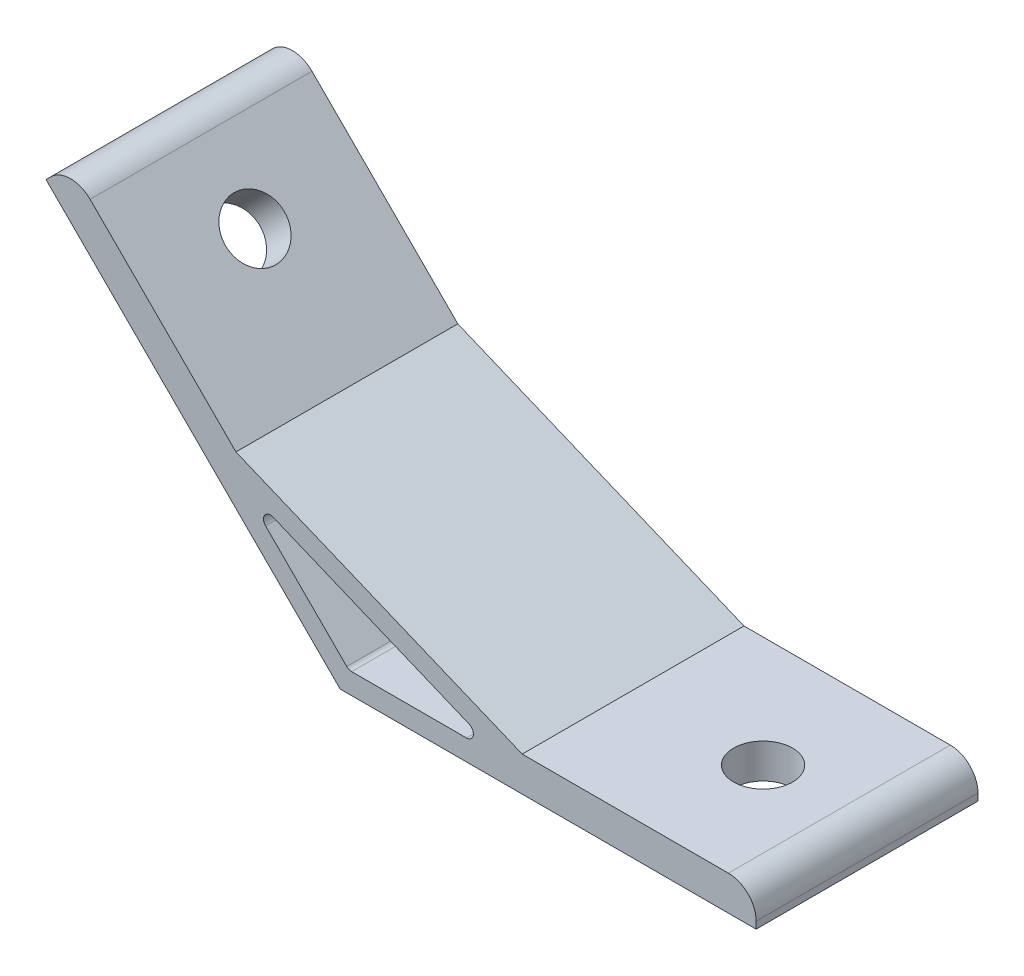
ISO-10303-21;
HEADER;
FILE_DESCRIPTION(('STEP AP214'),'2;1');
FILE_NAME('part.step','',(''),(''),'','','');
FILE_SCHEMA(('AUTOMOTIVE_DESIGN { 1 0 10303 214 1 1 1 1 }'));
ENDSEC;
DATA;
#1=APPLICATION_CONTEXT('core data for automotive mechanical design processes');
#2=APPLICATION_PROTOCOL_DEFINITION('international standard','automotive_design',2000,#1);
#3=PRODUCT_CONTEXT('',#1,'mechanical');
#4=PRODUCT('Part','Part','',(#3));
#5=PRODUCT_RELATED_PRODUCT_CATEGORY('part','',(#4));
#6=PRODUCT_DEFINITION_FORMATION('','',#4);
#7=PRODUCT_DEFINITION_CONTEXT('part definition',#1,'design');
#8=PRODUCT_DEFINITION('design','',#6,#7);
#9=PRODUCT_DEFINITION_SHAPE('','',#8);
#10=(LENGTH_UNIT() NAMED_UNIT(*) SI_UNIT(.MILLI.,.METRE.));
#11=(NAMED_UNIT(*) PLANE_ANGLE_UNIT() SI_UNIT($,.RADIAN.));
#12=(NAMED_UNIT(*) SI_UNIT($,.STERADIAN.) SOLID_ANGLE_UNIT());
#13=UNCERTAINTY_MEASURE_WITH_UNIT(LENGTH_MEASURE(1.E-05),#10,'distance_accuracy_value','');
#14=(GEOMETRIC_REPRESENTATION_CONTEXT(3) GLOBAL_UNCERTAINTY_ASSIGNED_CONTEXT((#13)) GLOBAL_UNIT_ASSIGNED_CONTEXT((#10,
#11,#12)) REPRESENTATION_CONTEXT('',''));
#15=CARTESIAN_POINT('',(0.,0.,0.));
#16=DIRECTION('',(0.,0.,1.));
#17=DIRECTION('',(1.,0.,0.));
#18=AXIS2_PLACEMENT_3D('',#15,#16,#17);
#19=CARTESIAN_POINT('',(0.,0.,16.));
#20=DIRECTION('',(0.,0.,1.));
#21=DIRECTION('',(1.,0.,0.));
#22=AXIS2_PLACEMENT_3D('',#19,#20,#21);
#23=PLANE('',#22);
#24=DIRECTION('',(0.,1.,0.));
#25=VECTOR('',#24,1.);
#26=CARTESIAN_POINT('',(60.,5.,16.));
#27=LINE('',#26,#25);
#28=CARTESIAN_POINT('',(60.,0.,16.));
#29=VERTEX_POINT('',#28);
#30=CARTESIAN_POINT('',(60.,1.,16.));
#31=VERTEX_POINT('',#30);
#32=EDGE_CURVE('E142',#29,#31,#27,.T.);
#33=ORIENTED_EDGE('',*,*,#32,.T.);
#34=CARTESIAN_POINT('',(56.,1.,16.));
#35=DIRECTION('',(0.,0.,1.));
#36=DIRECTION('',(1.,0.,0.));
#37=AXIS2_PLACEMENT_3D('',#34,#35,#36);
#38=CIRCLE('',#37,4.);
#39=CARTESIAN_POINT('',(56.,5.,16.));
#40=VERTEX_POINT('',#39);
#41=EDGE_CURVE('E184',#31,#40,#38,.T.);
#42=ORIENTED_EDGE('',*,*,#41,.T.);
#43=DIRECTION('',(-1.,0.,0.));
#44=VECTOR('',#43,1.);
#45=CARTESIAN_POINT('',(26.2535913516314,5.,16.));
#46=LINE('',#45,#44);
#47=CARTESIAN_POINT('',(26.2535913516314,5.,16.));
#48=VERTEX_POINT('',#47);
#49=EDGE_CURVE('E153',#40,#48,#46,.T.);
#50=ORIENTED_EDGE('',*,*,#49,.T.);
#51=DIRECTION('',(-0.923879532511286,0.382683432365091,0.));
#52=VECTOR('',#51,1.);
#53=CARTESIAN_POINT('',(-15.0285585693062,22.0996263811718,16.));
#54=LINE('',#53,#52);
#55=CARTESIAN_POINT('',(-15.0285585693062,22.0996263811718,16.));
#56=VERTEX_POINT('',#55);
#57=EDGE_CURVE('E244',#48,#56,#54,.T.);
#58=ORIENTED_EDGE('',*,*,#57,.T.);
#59=DIRECTION('',(-0.707106781186546,0.707106781186549,0.));
#60=VECTOR('',#59,1.);
#61=CARTESIAN_POINT('',(-38.89087296526,45.9619407771256,16.));
#62=LINE('',#61,#60);
#63=CARTESIAN_POINT('',(-36.0624458405138,43.1335136523795,16.));
#64=VERTEX_POINT('',#63);
#65=EDGE_CURVE('E246',#56,#64,#62,.T.);
#66=ORIENTED_EDGE('',*,*,#65,.T.);
#67=CARTESIAN_POINT('',(-38.89087296526,40.3050865276333,16.));
#68=DIRECTION('',(0.,0.,1.));
#69=DIRECTION('',(1.,0.,0.));
#70=AXIS2_PLACEMENT_3D('',#67,#68,#69);
#71=CIRCLE('',#70,4.);
#72=CARTESIAN_POINT('',(-41.7193000900062,43.1335136523795,16.));
#73=VERTEX_POINT('',#72);
#74=EDGE_CURVE('E182',#64,#73,#71,.T.);
#75=ORIENTED_EDGE('',*,*,#74,.T.);
#76=DIRECTION('',(-0.707106781186549,-0.707106781186546,0.));
#77=VECTOR('',#76,1.);
#78=CARTESIAN_POINT('',(-42.4264068711928,42.4264068711929,16.));
#79=LINE('',#78,#77);
#80=CARTESIAN_POINT('',(-42.4264068711928,42.4264068711929,16.));
#81=VERTEX_POINT('',#80);
#82=EDGE_CURVE('E249',#73,#81,#79,.T.);
#83=ORIENTED_EDGE('',*,*,#82,.T.);
#84=DIRECTION('',(0.707106781186546,-0.707106781186549,0.));
#85=VECTOR('',#84,1.);
#86=CARTESIAN_POINT('',(0.,0.,16.));
#87=LINE('',#86,#85);
#88=CARTESIAN_POINT('',(0.,0.,16.));
#89=VERTEX_POINT('',#88);
#90=EDGE_CURVE('E158',#81,#89,#87,.T.);
#91=ORIENTED_EDGE('',*,*,#90,.T.);
#92=DIRECTION('',(1.,0.,0.));
#93=VECTOR('',#92,1.);
#94=CARTESIAN_POINT('',(60.,0.,16.));
#95=LINE('',#94,#93);
#96=EDGE_CURVE('E154',#89,#29,#95,.T.);
#97=ORIENTED_EDGE('',*,*,#96,.T.);
#98=EDGE_LOOP('',(#33,#42,#50,#58,#66,#75,#83,#91,#97));
#99=FACE_BOUND('',#98,.T.);
#100=DIRECTION('',(1.,0.,0.));
#101=VECTOR('',#100,1.);
#102=CARTESIAN_POINT('',(23.2426406871193,3.,16.));
#103=LINE('',#102,#101);
#104=CARTESIAN_POINT('',(1.65685424949238,3.,16.));
#105=VERTEX_POINT('',#104);
#106=CARTESIAN_POINT('',(18.2153011949934,3.,16.));
#107=VERTEX_POINT('',#106);
#108=EDGE_CURVE('E229',#105,#107,#103,.T.);
#109=ORIENTED_EDGE('',*,*,#108,.F.);
#110=CARTESIAN_POINT('',(1.65685424949239,4.,16.));
#111=DIRECTION('',(0.,0.,1.));
#112=DIRECTION('',(1.,0.,0.));
#113=AXIS2_PLACEMENT_3D('',#110,#111,#112);
#114=CIRCLE('',#113,1.);
#115=CARTESIAN_POINT('',(0.949747468305837,3.29289321881345,16.));
#116=VERTEX_POINT('',#115);
#117=EDGE_CURVE('E211',#105,#116,#114,.F.);
#118=ORIENTED_EDGE('',*,*,#117,.T.);
#119=DIRECTION('',(0.707106781186546,-0.707106781186549,0.));
#120=VECTOR('',#119,1.);
#121=CARTESIAN_POINT('',(1.24264068711929,3.,16.));
#122=LINE('',#121,#120);
#123=CARTESIAN_POINT('',(-10.7588426527756,15.001483339895,16.));
#124=VERTEX_POINT('',#123);
#125=EDGE_CURVE('E226',#124,#116,#122,.T.);
#126=ORIENTED_EDGE('',*,*,#125,.F.);
#127=CARTESIAN_POINT('',(-10.0517358715891,15.7085901210815,16.));
#128=DIRECTION('',(0.,0.,1.));
#129=DIRECTION('',(1.,0.,0.));
#130=AXIS2_PLACEMENT_3D('',#127,#128,#129);
#131=CIRCLE('',#130,1.);
#132=CARTESIAN_POINT('',(-9.66905243922398,16.6324696535928,16.));
#133=VERTEX_POINT('',#132);
#134=EDGE_CURVE('E207',#124,#133,#131,.F.);
#135=ORIENTED_EDGE('',*,*,#134,.T.);
#136=DIRECTION('',(-0.923879532511286,0.382683432365091,0.));
#137=VECTOR('',#136,1.);
#138=CARTESIAN_POINT('',(-14.3137084989847,18.5563491861041,16.));
#139=LINE('',#138,#137);
#140=CARTESIAN_POINT('',(18.5979846273585,4.92387953251129,16.));
#141=VERTEX_POINT('',#140);
#142=EDGE_CURVE('E231',#141,#133,#139,.T.);
#143=ORIENTED_EDGE('',*,*,#142,.F.);
#144=CARTESIAN_POINT('',(18.2153011949934,4.,16.));
#145=DIRECTION('',(0.,0.,1.));
#146=DIRECTION('',(1.,0.,0.));
#147=AXIS2_PLACEMENT_3D('',#144,#145,#146);
#148=CIRCLE('',#147,1.);
#149=EDGE_CURVE('E11',#141,#107,#148,.F.);
#150=ORIENTED_EDGE('',*,*,#149,.T.);
#151=EDGE_LOOP('',(#109,#118,#126,#135,#143,#150));
#152=FACE_BOUND('',#151,.T.);
#153=ADVANCED_FACE('F35',(#99,#152),#23,.T.);
#154=CARTESIAN_POINT('',(0.,0.,-16.));
#155=DIRECTION('',(0.,0.,1.));
#156=DIRECTION('',(1.,0.,0.));
#157=AXIS2_PLACEMENT_3D('',#154,#155,#156);
#158=PLANE('',#157);
#159=DIRECTION('',(-1.,0.,0.));
#160=VECTOR('',#159,1.);
#161=CARTESIAN_POINT('',(26.2535913516314,5.,-16.));
#162=LINE('',#161,#160);
#163=CARTESIAN_POINT('',(56.,5.,-16.));
#164=VERTEX_POINT('',#163);
#165=CARTESIAN_POINT('',(26.2535913516314,5.,-16.));
#166=VERTEX_POINT('',#165);
#167=EDGE_CURVE('E256',#164,#166,#162,.T.);
#168=ORIENTED_EDGE('',*,*,#167,.F.);
#169=CARTESIAN_POINT('',(56.,1.,-16.));
#170=DIRECTION('',(0.,0.,1.));
#171=DIRECTION('',(1.,0.,0.));
#172=AXIS2_PLACEMENT_3D('',#169,#170,#171);
#173=CIRCLE('',#172,4.);
#174=CARTESIAN_POINT('',(60.,1.,-16.));
#175=VERTEX_POINT('',#174);
#176=EDGE_CURVE('E179',#164,#175,#173,.F.);
#177=ORIENTED_EDGE('',*,*,#176,.T.);
#178=DIRECTION('',(0.,1.,0.));
#179=VECTOR('',#178,1.);
#180=CARTESIAN_POINT('',(60.,5.,-16.));
#181=LINE('',#180,#179);
#182=CARTESIAN_POINT('',(60.,0.,-16.));
#183=VERTEX_POINT('',#182);
#184=EDGE_CURVE('E254',#183,#175,#181,.T.);
#185=ORIENTED_EDGE('',*,*,#184,.F.);
#186=DIRECTION('',(1.,0.,0.));
#187=VECTOR('',#186,1.);
#188=CARTESIAN_POINT('',(60.,0.,-16.));
#189=LINE('',#188,#187);
#190=CARTESIAN_POINT('',(0.,0.,-16.));
#191=VERTEX_POINT('',#190);
#192=EDGE_CURVE('E166',#191,#183,#189,.T.);
#193=ORIENTED_EDGE('',*,*,#192,.F.);
#194=DIRECTION('',(0.707106781186546,-0.707106781186549,0.));
#195=VECTOR('',#194,1.);
#196=CARTESIAN_POINT('',(0.,0.,-16.));
#197=LINE('',#196,#195);
#198=CARTESIAN_POINT('',(-42.4264068711928,42.4264068711929,-16.));
#199=VERTEX_POINT('',#198);
#200=EDGE_CURVE('E162',#199,#191,#197,.T.);
#201=ORIENTED_EDGE('',*,*,#200,.F.);
#202=DIRECTION('',(-0.707106781186549,-0.707106781186546,0.));
#203=VECTOR('',#202,1.);
#204=CARTESIAN_POINT('',(-42.4264068711928,42.4264068711929,-16.));
#205=LINE('',#204,#203);
#206=CARTESIAN_POINT('',(-41.7193000900062,43.1335136523795,-16.));
#207=VERTEX_POINT('',#206);
#208=EDGE_CURVE('E263',#207,#199,#205,.T.);
#209=ORIENTED_EDGE('',*,*,#208,.F.);
#210=CARTESIAN_POINT('',(-38.89087296526,40.3050865276333,-16.));
#211=DIRECTION('',(0.,0.,1.));
#212=DIRECTION('',(1.,0.,0.));
#213=AXIS2_PLACEMENT_3D('',#210,#211,#212);
#214=CIRCLE('',#213,4.);
#215=CARTESIAN_POINT('',(-36.0624458405138,43.1335136523795,-16.));
#216=VERTEX_POINT('',#215);
#217=EDGE_CURVE('E171',#207,#216,#214,.F.);
#218=ORIENTED_EDGE('',*,*,#217,.T.);
#219=DIRECTION('',(-0.707106781186546,0.707106781186549,0.));
#220=VECTOR('',#219,1.);
#221=CARTESIAN_POINT('',(-38.89087296526,45.9619407771256,-16.));
#222=LINE('',#221,#220);
#223=CARTESIAN_POINT('',(-15.0285585693062,22.0996263811718,-16.));
#224=VERTEX_POINT('',#223);
#225=EDGE_CURVE('E260',#224,#216,#222,.T.);
#226=ORIENTED_EDGE('',*,*,#225,.F.);
#227=DIRECTION('',(-0.923879532511286,0.382683432365091,0.));
#228=VECTOR('',#227,1.);
#229=CARTESIAN_POINT('',(-15.0285585693062,22.0996263811718,-16.));
#230=LINE('',#229,#228);
#231=EDGE_CURVE('E258',#166,#224,#230,.T.);
#232=ORIENTED_EDGE('',*,*,#231,.F.);
#233=EDGE_LOOP('',(#168,#177,#185,#193,#201,#209,#218,#226,#232));
#234=FACE_BOUND('',#233,.T.);
#235=DIRECTION('',(-0.923879532511286,0.382683432365091,0.));
#236=VECTOR('',#235,1.);
#237=CARTESIAN_POINT('',(-14.3137084989847,18.5563491861041,-16.));
#238=LINE('',#237,#236);
#239=CARTESIAN_POINT('',(18.5979846273585,4.92387953251129,-16.));
#240=VERTEX_POINT('',#239);
#241=CARTESIAN_POINT('',(-9.66905243922398,16.6324696535928,-16.));
#242=VERTEX_POINT('',#241);
#243=EDGE_CURVE('E217',#240,#242,#238,.T.);
#244=ORIENTED_EDGE('',*,*,#243,.T.);
#245=CARTESIAN_POINT('',(-10.0517358715891,15.7085901210815,-16.));
#246=DIRECTION('',(0.,0.,1.));
#247=DIRECTION('',(1.,0.,0.));
#248=AXIS2_PLACEMENT_3D('',#245,#246,#247);
#249=CIRCLE('',#248,1.);
#250=CARTESIAN_POINT('',(-10.7588426527756,15.001483339895,-16.));
#251=VERTEX_POINT('',#250);
#252=EDGE_CURVE('E205',#242,#251,#249,.T.);
#253=ORIENTED_EDGE('',*,*,#252,.T.);
#254=DIRECTION('',(0.707106781186546,-0.707106781186549,0.));
#255=VECTOR('',#254,1.);
#256=CARTESIAN_POINT('',(1.24264068711929,3.,-16.));
#257=LINE('',#256,#255);
#258=CARTESIAN_POINT('',(0.949747468305837,3.29289321881345,-16.));
#259=VERTEX_POINT('',#258);
#260=EDGE_CURVE('E238',#251,#259,#257,.T.);
#261=ORIENTED_EDGE('',*,*,#260,.T.);
#262=CARTESIAN_POINT('',(1.65685424949239,4.,-16.));
#263=DIRECTION('',(0.,0.,1.));
#264=DIRECTION('',(1.,0.,0.));
#265=AXIS2_PLACEMENT_3D('',#262,#263,#264);
#266=CIRCLE('',#265,1.);
#267=CARTESIAN_POINT('',(1.65685424949238,3.,-16.));
#268=VERTEX_POINT('',#267);
#269=EDGE_CURVE('E209',#259,#268,#266,.T.);
#270=ORIENTED_EDGE('',*,*,#269,.T.);
#271=DIRECTION('',(1.,0.,0.));
#272=VECTOR('',#271,1.);
#273=CARTESIAN_POINT('',(23.2426406871193,3.,-16.));
#274=LINE('',#273,#272);
#275=CARTESIAN_POINT('',(18.2153011949934,3.,-16.));
#276=VERTEX_POINT('',#275);
#277=EDGE_CURVE('E218',#268,#276,#274,.T.);
#278=ORIENTED_EDGE('',*,*,#277,.T.);
#279=CARTESIAN_POINT('',(18.2153011949934,4.,-16.));
#280=DIRECTION('',(0.,0.,1.));
#281=DIRECTION('',(1.,0.,0.));
#282=AXIS2_PLACEMENT_3D('',#279,#280,#281);
#283=CIRCLE('',#282,1.);
#284=EDGE_CURVE('E43',#276,#240,#283,.T.);
#285=ORIENTED_EDGE('',*,*,#284,.T.);
#286=EDGE_LOOP('',(#244,#253,#261,#270,#278,#285));
#287=FACE_BOUND('',#286,.T.);
#288=ADVANCED_FACE('F216',(#234,#287),#158,.F.);
#289=CARTESIAN_POINT('',(60.,0.,16.));
#290=DIRECTION('',(0.,1.,0.));
#291=DIRECTION('',(0.,0.,1.));
#292=AXIS2_PLACEMENT_3D('',#289,#290,#291);
#293=PLANE('',#292);
#294=CARTESIAN_POINT('',(45.,0.,0.));
#295=DIRECTION('',(0.,-1.,0.));
#296=DIRECTION('',(0.,0.,-1.));
#297=AXIS2_PLACEMENT_3D('',#294,#295,#296);
#298=CIRCLE('',#297,4.25000000000001);
#299=CARTESIAN_POINT('',(45.,0.,-4.25000000000001));
#300=VERTEX_POINT('',#299);
#301=EDGE_CURVE('E343',#300,#300,#298,.T.);
#302=ORIENTED_EDGE('',*,*,#301,.F.);
#303=EDGE_LOOP('',(#302));
#304=FACE_BOUND('',#303,.T.);
#305=ORIENTED_EDGE('',*,*,#192,.T.);
#306=DIRECTION('',(0.,0.,-1.));
#307=VECTOR('',#306,1.);
#308=CARTESIAN_POINT('',(60.,0.,16.));
#309=LINE('',#308,#307);
#310=EDGE_CURVE('E147',#29,#183,#309,.T.);
#311=ORIENTED_EDGE('',*,*,#310,.F.);
#312=ORIENTED_EDGE('',*,*,#96,.F.);
#313=DIRECTION('',(0.,0.,-1.));
#314=VECTOR('',#313,1.);
#315=CARTESIAN_POINT('',(0.,0.,16.));
#316=LINE('',#315,#314);
#317=EDGE_CURVE('E252',#89,#191,#316,.T.);
#318=ORIENTED_EDGE('',*,*,#317,.T.);
#319=EDGE_LOOP('',(#305,#311,#312,#318));
#320=FACE_BOUND('',#319,.T.);
#321=ADVANCED_FACE('F164',(#304,#320),#293,.F.);
#322=CARTESIAN_POINT('',(60.,5.,16.));
#323=DIRECTION('',(-1.,0.,0.));
#324=DIRECTION('',(0.,0.,1.));
#325=AXIS2_PLACEMENT_3D('',#322,#323,#324);
#326=PLANE('',#325);
#327=ORIENTED_EDGE('',*,*,#184,.T.);
#328=DIRECTION('',(0.,0.,-1.));
#329=VECTOR('',#328,1.);
#330=CARTESIAN_POINT('',(60.,1.,16.));
#331=LINE('',#330,#329);
#332=EDGE_CURVE('E150',#175,#31,#331,.F.);
#333=ORIENTED_EDGE('',*,*,#332,.T.);
#334=ORIENTED_EDGE('',*,*,#32,.F.);
#335=ORIENTED_EDGE('',*,*,#310,.T.);
#336=EDGE_LOOP('',(#327,#333,#334,#335));
#337=FACE_BOUND('',#336,.T.);
#338=ADVANCED_FACE('F145',(#337),#326,.F.);
#339=CARTESIAN_POINT('',(26.2535913516314,5.,16.));
#340=DIRECTION('',(0.,-1.,0.));
#341=DIRECTION('',(0.,0.,-1.));
#342=AXIS2_PLACEMENT_3D('',#339,#340,#341);
#343=PLANE('',#342);
#344=CARTESIAN_POINT('',(45.,5.,0.));
#345=DIRECTION('',(0.,-1.,0.));
#346=DIRECTION('',(0.,0.,-1.));
#347=AXIS2_PLACEMENT_3D('',#344,#345,#346);
#348=CIRCLE('',#347,4.25000000000001);
#349=CARTESIAN_POINT('',(45.,5.,-4.25000000000001));
#350=VERTEX_POINT('',#349);
#351=EDGE_CURVE('E345',#350,#350,#348,.F.);
#352=ORIENTED_EDGE('',*,*,#351,.F.);
#353=EDGE_LOOP('',(#352));
#354=FACE_BOUND('',#353,.T.);
#355=ORIENTED_EDGE('',*,*,#49,.F.);
#356=DIRECTION('',(0.,0.,-1.));
#357=VECTOR('',#356,1.);
#358=CARTESIAN_POINT('',(56.,5.,16.));
#359=LINE('',#358,#357);
#360=EDGE_CURVE('E167',#40,#164,#359,.T.);
#361=ORIENTED_EDGE('',*,*,#360,.T.);
#362=ORIENTED_EDGE('',*,*,#167,.T.);
#363=DIRECTION('',(0.,0.,-1.));
#364=VECTOR('',#363,1.);
#365=CARTESIAN_POINT('',(26.2535913516314,5.,16.));
#366=LINE('',#365,#364);
#367=EDGE_CURVE('E168',#48,#166,#366,.T.);
#368=ORIENTED_EDGE('',*,*,#367,.F.);
#369=EDGE_LOOP('',(#355,#361,#362,#368));
#370=FACE_BOUND('',#369,.T.);
#371=ADVANCED_FACE('F295',(#354,#370),#343,.F.);
#372=CARTESIAN_POINT('',(-15.0285585693062,22.0996263811718,16.));
#373=DIRECTION('',(-0.382683432365091,-0.923879532511286,0.));
#374=DIRECTION('',(0.923879532511287,-0.382683432365091,0.));
#375=AXIS2_PLACEMENT_3D('',#372,#373,#374);
#376=PLANE('',#375);
#377=ORIENTED_EDGE('',*,*,#231,.T.);
#378=DIRECTION('',(0.,0.,-1.));
#379=VECTOR('',#378,1.);
#380=CARTESIAN_POINT('',(-15.0285585693062,22.0996263811718,16.));
#381=LINE('',#380,#379);
#382=EDGE_CURVE('E174',#56,#224,#381,.T.);
#383=ORIENTED_EDGE('',*,*,#382,.F.);
#384=ORIENTED_EDGE('',*,*,#57,.F.);
#385=ORIENTED_EDGE('',*,*,#367,.T.);
#386=EDGE_LOOP('',(#377,#383,#384,#385));
#387=FACE_BOUND('',#386,.T.);
#388=ADVANCED_FACE('F293',(#387),#376,.F.);
#389=CARTESIAN_POINT('',(-38.89087296526,45.9619407771256,16.));
#390=DIRECTION('',(-0.707106781186549,-0.707106781186546,0.));
#391=DIRECTION('',(0.707106781186546,-0.707106781186549,0.));
#392=AXIS2_PLACEMENT_3D('',#389,#390,#391);
#393=PLANE('',#392);
#394=CARTESIAN_POINT('',(-28.2842712474618,35.3553390593274,0.));
#395=DIRECTION('',(-0.707106781186549,-0.707106781186546,0.));
#396=DIRECTION('',(0.707106781186546,-0.707106781186549,0.));
#397=AXIS2_PLACEMENT_3D('',#394,#395,#396);
#398=CIRCLE('',#397,4.25);
#399=CARTESIAN_POINT('',(-25.279067427419,32.3501352392846,0.));
#400=VERTEX_POINT('',#399);
#401=EDGE_CURVE('E241',#400,#400,#398,.F.);
#402=ORIENTED_EDGE('',*,*,#401,.F.);
#403=EDGE_LOOP('',(#402));
#404=FACE_BOUND('',#403,.T.);
#405=ORIENTED_EDGE('',*,*,#225,.T.);
#406=DIRECTION('',(0.,0.,-1.));
#407=VECTOR('',#406,1.);
#408=CARTESIAN_POINT('',(-36.0624458405138,43.1335136523795,16.));
#409=LINE('',#408,#407);
#410=EDGE_CURVE('E189',#216,#64,#409,.F.);
#411=ORIENTED_EDGE('',*,*,#410,.T.);
#412=ORIENTED_EDGE('',*,*,#65,.F.);
#413=ORIENTED_EDGE('',*,*,#382,.T.);
#414=EDGE_LOOP('',(#405,#411,#412,#413));
#415=FACE_BOUND('',#414,.T.);
#416=ADVANCED_FACE('F274',(#404,#415),#393,.F.);
#417=CARTESIAN_POINT('',(-42.4264068711928,42.4264068711929,16.));
#418=DIRECTION('',(0.707106781186546,-0.707106781186549,0.));
#419=DIRECTION('',(0.707106781186549,0.707106781186546,0.));
#420=AXIS2_PLACEMENT_3D('',#417,#418,#419);
#421=PLANE('',#420);
#422=ORIENTED_EDGE('',*,*,#82,.F.);
#423=DIRECTION('',(0.,0.,-1.));
#424=VECTOR('',#423,1.);
#425=CARTESIAN_POINT('',(-41.7193000900062,43.1335136523795,16.));
#426=LINE('',#425,#424);
#427=EDGE_CURVE('E186',#73,#207,#426,.T.);
#428=ORIENTED_EDGE('',*,*,#427,.T.);
#429=ORIENTED_EDGE('',*,*,#208,.T.);
#430=DIRECTION('',(0.,0.,-1.));
#431=VECTOR('',#430,1.);
#432=CARTESIAN_POINT('',(-42.4264068711928,42.4264068711929,16.));
#433=LINE('',#432,#431);
#434=EDGE_CURVE('E267',#81,#199,#433,.T.);
#435=ORIENTED_EDGE('',*,*,#434,.F.);
#436=EDGE_LOOP('',(#422,#428,#429,#435));
#437=FACE_BOUND('',#436,.T.);
#438=ADVANCED_FACE('F289',(#437),#421,.F.);
#439=CARTESIAN_POINT('',(0.,0.,16.));
#440=DIRECTION('',(0.707106781186549,0.707106781186546,0.));
#441=DIRECTION('',(-0.707106781186546,0.707106781186549,0.));
#442=AXIS2_PLACEMENT_3D('',#439,#440,#441);
#443=PLANE('',#442);
#444=CARTESIAN_POINT('',(-31.8198051533946,31.8198051533947,0.));
#445=DIRECTION('',(-0.707106781186549,-0.707106781186546,0.));
#446=DIRECTION('',(0.707106781186546,-0.707106781186549,0.));
#447=AXIS2_PLACEMENT_3D('',#444,#445,#446);
#448=CIRCLE('',#447,4.25);
#449=CARTESIAN_POINT('',(-28.8146013333518,28.8146013333519,0.));
#450=VERTEX_POINT('',#449);
#451=EDGE_CURVE('E348',#450,#450,#448,.T.);
#452=ORIENTED_EDGE('',*,*,#451,.F.);
#453=EDGE_LOOP('',(#452));
#454=FACE_BOUND('',#453,.T.);
#455=ORIENTED_EDGE('',*,*,#200,.T.);
#456=ORIENTED_EDGE('',*,*,#317,.F.);
#457=ORIENTED_EDGE('',*,*,#90,.F.);
#458=ORIENTED_EDGE('',*,*,#434,.T.);
#459=EDGE_LOOP('',(#455,#456,#457,#458));
#460=FACE_BOUND('',#459,.T.);
#461=ADVANCED_FACE('F322',(#454,#460),#443,.F.);
#462=CARTESIAN_POINT('',(1.24264068711929,3.,16.));
#463=DIRECTION('',(0.707106781186549,0.707106781186546,0.));
#464=DIRECTION('',(-0.707106781186546,0.707106781186549,0.));
#465=AXIS2_PLACEMENT_3D('',#462,#463,#464);
#466=PLANE('',#465);
#467=ORIENTED_EDGE('',*,*,#260,.F.);
#468=DIRECTION('',(0.,0.,-1.));
#469=VECTOR('',#468,1.);
#470=CARTESIAN_POINT('',(-10.7588426527756,15.0014833398949,16.));
#471=LINE('',#470,#469);
#472=EDGE_CURVE('E199',#251,#124,#471,.F.);
#473=ORIENTED_EDGE('',*,*,#472,.T.);
#474=ORIENTED_EDGE('',*,*,#125,.T.);
#475=DIRECTION('',(0.,0.,-1.));
#476=VECTOR('',#475,1.);
#477=CARTESIAN_POINT('',(0.949747468305837,3.29289321881345,-16.));
#478=LINE('',#477,#476);
#479=EDGE_CURVE('E196',#116,#259,#478,.T.);
#480=ORIENTED_EDGE('',*,*,#479,.T.);
#481=EDGE_LOOP('',(#467,#473,#474,#480));
#482=FACE_BOUND('',#481,.T.);
#483=ADVANCED_FACE('F319',(#482),#466,.T.);
#484=CARTESIAN_POINT('',(23.2426406871193,3.,16.));
#485=DIRECTION('',(0.,1.,0.));
#486=DIRECTION('',(0.,0.,1.));
#487=AXIS2_PLACEMENT_3D('',#484,#485,#486);
#488=PLANE('',#487);
#489=ORIENTED_EDGE('',*,*,#277,.F.);
#490=DIRECTION('',(0.,0.,-1.));
#491=VECTOR('',#490,1.);
#492=CARTESIAN_POINT('',(1.65685424949239,3.,16.));
#493=LINE('',#492,#491);
#494=EDGE_CURVE('E55',#268,#105,#493,.F.);
#495=ORIENTED_EDGE('',*,*,#494,.T.);
#496=ORIENTED_EDGE('',*,*,#108,.T.);
#497=DIRECTION('',(0.,0.,-1.));
#498=VECTOR('',#497,1.);
#499=CARTESIAN_POINT('',(18.2153011949934,3.,-16.));
#500=LINE('',#499,#498);
#501=EDGE_CURVE('E201',#107,#276,#500,.T.);
#502=ORIENTED_EDGE('',*,*,#501,.T.);
#503=EDGE_LOOP('',(#489,#495,#496,#502));
#504=FACE_BOUND('',#503,.T.);
#505=ADVANCED_FACE('F228',(#504),#488,.T.);
#506=CARTESIAN_POINT('',(-14.3137084989847,18.5563491861041,16.));
#507=DIRECTION('',(-0.382683432365091,-0.923879532511286,0.));
#508=DIRECTION('',(0.923879532511286,-0.382683432365091,0.));
#509=AXIS2_PLACEMENT_3D('',#506,#507,#508);
#510=PLANE('',#509);
#511=ORIENTED_EDGE('',*,*,#142,.T.);
#512=DIRECTION('',(0.,0.,-1.));
#513=VECTOR('',#512,1.);
#514=CARTESIAN_POINT('',(-9.66905243922398,16.6324696535928,-16.));
#515=LINE('',#514,#513);
#516=EDGE_CURVE('E193',#133,#242,#515,.T.);
#517=ORIENTED_EDGE('',*,*,#516,.T.);
#518=ORIENTED_EDGE('',*,*,#243,.F.);
#519=DIRECTION('',(0.,0.,-1.));
#520=VECTOR('',#519,1.);
#521=CARTESIAN_POINT('',(18.5979846273585,4.92387953251129,16.));
#522=LINE('',#521,#520);
#523=EDGE_CURVE('E191',#240,#141,#522,.F.);
#524=ORIENTED_EDGE('',*,*,#523,.T.);
#525=EDGE_LOOP('',(#511,#517,#518,#524));
#526=FACE_BOUND('',#525,.T.);
#527=ADVANCED_FACE('F224',(#526),#510,.T.);
#528=CARTESIAN_POINT('',(-19.7842712474618,43.8553390593274,0.));
#529=DIRECTION('',(-0.707106781186549,-0.707106781186546,0.));
#530=DIRECTION('',(0.707106781186546,-0.707106781186549,0.));
#531=AXIS2_PLACEMENT_3D('',#528,#529,#530);
#532=CYLINDRICAL_SURFACE('',#531,4.25);
#533=ORIENTED_EDGE('',*,*,#401,.T.);
#534=EDGE_LOOP('',(#533));
#535=FACE_BOUND('',#534,.T.);
#536=ORIENTED_EDGE('',*,*,#451,.T.);
#537=EDGE_LOOP('',(#536));
#538=FACE_BOUND('',#537,.T.);
#539=ADVANCED_FACE('F308',(#535,#538),#532,.F.);
#540=CARTESIAN_POINT('',(45.,17.0208152801713,0.));
#541=DIRECTION('',(0.,-1.,0.));
#542=DIRECTION('',(0.,0.,-1.));
#543=AXIS2_PLACEMENT_3D('',#540,#541,#542);
#544=CYLINDRICAL_SURFACE('',#543,4.25000000000001);
#545=ORIENTED_EDGE('',*,*,#351,.T.);
#546=EDGE_LOOP('',(#545));
#547=FACE_BOUND('',#546,.T.);
#548=ORIENTED_EDGE('',*,*,#301,.T.);
#549=EDGE_LOOP('',(#548));
#550=FACE_BOUND('',#549,.T.);
#551=ADVANCED_FACE('F300',(#547,#550),#544,.F.);
#552=CARTESIAN_POINT('',(56.,1.,16.));
#553=DIRECTION('',(0.,0.,-1.));
#554=DIRECTION('',(-1.,0.,0.));
#555=AXIS2_PLACEMENT_3D('',#552,#553,#554);
#556=CYLINDRICAL_SURFACE('',#555,4.);
#557=ORIENTED_EDGE('',*,*,#41,.F.);
#558=ORIENTED_EDGE('',*,*,#332,.F.);
#559=ORIENTED_EDGE('',*,*,#176,.F.);
#560=ORIENTED_EDGE('',*,*,#360,.F.);
#561=EDGE_LOOP('',(#557,#558,#559,#560));
#562=FACE_BOUND('',#561,.T.);
#563=ADVANCED_FACE('F298',(#562),#556,.T.);
#564=CARTESIAN_POINT('',(-38.89087296526,40.3050865276333,16.));
#565=DIRECTION('',(0.,0.,-1.));
#566=DIRECTION('',(-1.,0.,0.));
#567=AXIS2_PLACEMENT_3D('',#564,#565,#566);
#568=CYLINDRICAL_SURFACE('',#567,4.);
#569=ORIENTED_EDGE('',*,*,#74,.F.);
#570=ORIENTED_EDGE('',*,*,#410,.F.);
#571=ORIENTED_EDGE('',*,*,#217,.F.);
#572=ORIENTED_EDGE('',*,*,#427,.F.);
#573=EDGE_LOOP('',(#569,#570,#571,#572));
#574=FACE_BOUND('',#573,.T.);
#575=ADVANCED_FACE('F286',(#574),#568,.T.);
#576=CARTESIAN_POINT('',(-10.0517358715891,15.7085901210815,16.));
#577=DIRECTION('',(0.,0.,1.));
#578=DIRECTION('',(1.,0.,0.));
#579=AXIS2_PLACEMENT_3D('',#576,#577,#578);
#580=CYLINDRICAL_SURFACE('',#579,1.);
#581=ORIENTED_EDGE('',*,*,#134,.F.);
#582=ORIENTED_EDGE('',*,*,#472,.F.);
#583=ORIENTED_EDGE('',*,*,#252,.F.);
#584=ORIENTED_EDGE('',*,*,#516,.F.);
#585=EDGE_LOOP('',(#581,#582,#583,#584));
#586=FACE_BOUND('',#585,.T.);
#587=ADVANCED_FACE('F306',(#586),#580,.F.);
#588=CARTESIAN_POINT('',(1.65685424949239,4.,16.));
#589=DIRECTION('',(0.,0.,1.));
#590=DIRECTION('',(1.,0.,0.));
#591=AXIS2_PLACEMENT_3D('',#588,#589,#590);
#592=CYLINDRICAL_SURFACE('',#591,1.);
#593=ORIENTED_EDGE('',*,*,#117,.F.);
#594=ORIENTED_EDGE('',*,*,#494,.F.);
#595=ORIENTED_EDGE('',*,*,#269,.F.);
#596=ORIENTED_EDGE('',*,*,#479,.F.);
#597=EDGE_LOOP('',(#593,#594,#595,#596));
#598=FACE_BOUND('',#597,.T.);
#599=ADVANCED_FACE('F378',(#598),#592,.F.);
#600=CARTESIAN_POINT('',(18.2153011949934,4.,16.));
#601=DIRECTION('',(0.,0.,1.));
#602=DIRECTION('',(1.,0.,0.));
#603=AXIS2_PLACEMENT_3D('',#600,#601,#602);
#604=CYLINDRICAL_SURFACE('',#603,1.);
#605=ORIENTED_EDGE('',*,*,#149,.F.);
#606=ORIENTED_EDGE('',*,*,#523,.F.);
#607=ORIENTED_EDGE('',*,*,#284,.F.);
#608=ORIENTED_EDGE('',*,*,#501,.F.);
#609=EDGE_LOOP('',(#605,#606,#607,#608));
#610=FACE_BOUND('',#609,.T.);
#611=ADVANCED_FACE('F37',(#610),#604,.F.);
#612=CLOSED_SHELL('',(#153,#288,#321,#338,#371,#388,#416,#438,#461,#483,#505,#527,#539,#551,
#563,#575,#587,#599,#611));
#613=MANIFOLD_SOLID_BREP('B2',#612);
#614=ADVANCED_BREP_SHAPE_REPRESENTATION('',(#18,#613),#14);
#615=SHAPE_DEFINITION_REPRESENTATION(#9,#614);
ENDSEC;
END-ISO-10303-21;
